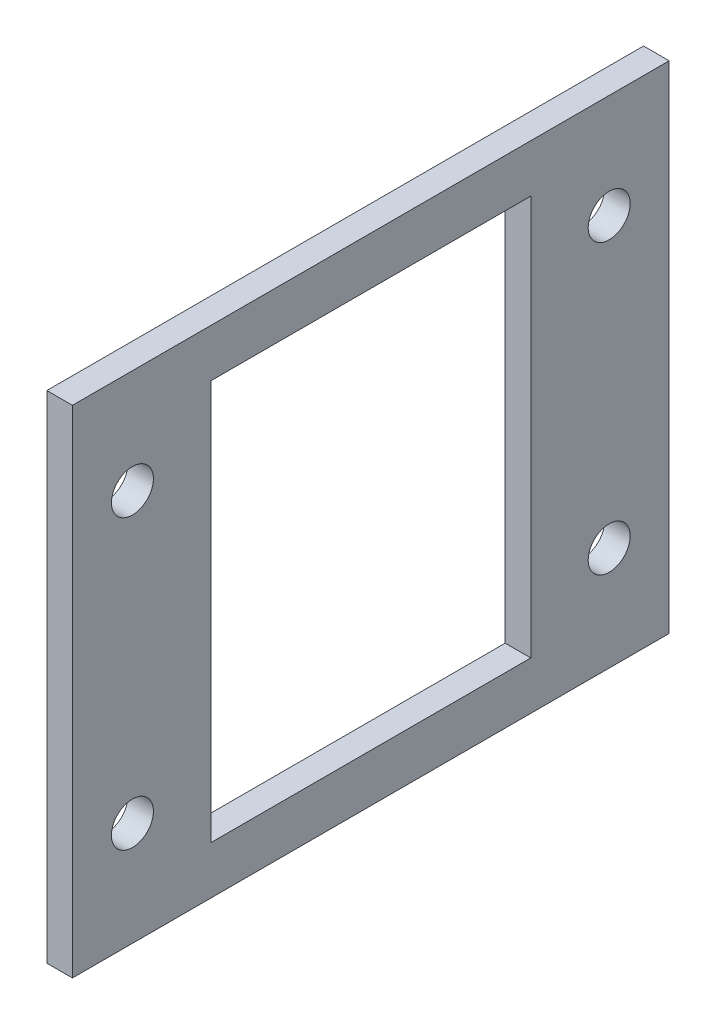
ISO-10303-21;
HEADER;
FILE_DESCRIPTION(('STEP AP214'),'2;1');
FILE_NAME('part.step','',(''),(''),'','','');
FILE_SCHEMA(('AUTOMOTIVE_DESIGN { 1 0 10303 214 1 1 1 1 }'));
ENDSEC;
DATA;
#1=APPLICATION_CONTEXT('core data for automotive mechanical design processes');
#2=APPLICATION_PROTOCOL_DEFINITION('international standard','automotive_design',2000,#1);
#3=PRODUCT_CONTEXT('',#1,'mechanical');
#4=PRODUCT('Part','Part','',(#3));
#5=PRODUCT_RELATED_PRODUCT_CATEGORY('part','',(#4));
#6=PRODUCT_DEFINITION_FORMATION('','',#4);
#7=PRODUCT_DEFINITION_CONTEXT('part definition',#1,'design');
#8=PRODUCT_DEFINITION('design','',#6,#7);
#9=PRODUCT_DEFINITION_SHAPE('','',#8);
#10=(LENGTH_UNIT() NAMED_UNIT(*) SI_UNIT(.MILLI.,.METRE.));
#11=(NAMED_UNIT(*) PLANE_ANGLE_UNIT() SI_UNIT($,.RADIAN.));
#12=(NAMED_UNIT(*) SI_UNIT($,.STERADIAN.) SOLID_ANGLE_UNIT());
#13=UNCERTAINTY_MEASURE_WITH_UNIT(LENGTH_MEASURE(1.E-05),#10,'distance_accuracy_value','');
#14=(GEOMETRIC_REPRESENTATION_CONTEXT(3) GLOBAL_UNCERTAINTY_ASSIGNED_CONTEXT((#13)) GLOBAL_UNIT_ASSIGNED_CONTEXT((#10,
#11,#12)) REPRESENTATION_CONTEXT('',''));
#15=CARTESIAN_POINT('',(0.,0.,0.));
#16=DIRECTION('',(0.,0.,1.));
#17=DIRECTION('',(1.,0.,0.));
#18=AXIS2_PLACEMENT_3D('',#15,#16,#17);
#19=CARTESIAN_POINT('',(3.2,0.,0.));
#20=DIRECTION('',(0.,0.,-1.));
#21=DIRECTION('',(-1.,0.,0.));
#22=AXIS2_PLACEMENT_3D('',#19,#20,#21);
#23=PLANE('',#22);
#24=DIRECTION('',(0.,-1.,0.));
#25=VECTOR('',#24,1.);
#26=CARTESIAN_POINT('',(0.,0.,0.));
#27=LINE('',#26,#25);
#28=CARTESIAN_POINT('',(0.,62.,0.));
#29=VERTEX_POINT('',#28);
#30=CARTESIAN_POINT('',(0.,0.,0.));
#31=VERTEX_POINT('',#30);
#32=EDGE_CURVE('E103',#29,#31,#27,.T.);
#33=ORIENTED_EDGE('',*,*,#32,.T.);
#34=DIRECTION('',(-1.,0.,0.));
#35=VECTOR('',#34,1.);
#36=CARTESIAN_POINT('',(3.2,0.,0.));
#37=LINE('',#36,#35);
#38=CARTESIAN_POINT('',(3.2,0.,0.));
#39=VERTEX_POINT('',#38);
#40=EDGE_CURVE('E11',#39,#31,#37,.T.);
#41=ORIENTED_EDGE('',*,*,#40,.F.);
#42=DIRECTION('',(0.,-1.,0.));
#43=VECTOR('',#42,1.);
#44=CARTESIAN_POINT('',(3.2,0.,0.));
#45=LINE('',#44,#43);
#46=CARTESIAN_POINT('',(3.2,62.,0.));
#47=VERTEX_POINT('',#46);
#48=EDGE_CURVE('E132',#47,#39,#45,.T.);
#49=ORIENTED_EDGE('',*,*,#48,.F.);
#50=DIRECTION('',(-1.,0.,0.));
#51=VECTOR('',#50,1.);
#52=CARTESIAN_POINT('',(3.2,62.,0.));
#53=LINE('',#52,#51);
#54=EDGE_CURVE('E142',#47,#29,#53,.T.);
#55=ORIENTED_EDGE('',*,*,#54,.T.);
#56=EDGE_LOOP('',(#33,#41,#49,#55));
#57=FACE_BOUND('',#56,.T.);
#58=ADVANCED_FACE('F33',(#57),#23,.F.);
#59=CARTESIAN_POINT('',(3.2,0.,0.));
#60=DIRECTION('',(0.,1.,0.));
#61=DIRECTION('',(0.,0.,1.));
#62=AXIS2_PLACEMENT_3D('',#59,#60,#61);
#63=PLANE('',#62);
#64=DIRECTION('',(0.,0.,-1.));
#65=VECTOR('',#64,1.);
#66=CARTESIAN_POINT('',(0.,0.,0.));
#67=LINE('',#66,#65);
#68=CARTESIAN_POINT('',(0.,0.,-74.6));
#69=VERTEX_POINT('',#68);
#70=EDGE_CURVE('E145',#31,#69,#67,.T.);
#71=ORIENTED_EDGE('',*,*,#70,.T.);
#72=DIRECTION('',(-1.,0.,0.));
#73=VECTOR('',#72,1.);
#74=CARTESIAN_POINT('',(3.2,0.,-74.6));
#75=LINE('',#74,#73);
#76=CARTESIAN_POINT('',(3.2,0.,-74.6));
#77=VERTEX_POINT('',#76);
#78=EDGE_CURVE('E40',#77,#69,#75,.T.);
#79=ORIENTED_EDGE('',*,*,#78,.F.);
#80=DIRECTION('',(0.,0.,-1.));
#81=VECTOR('',#80,1.);
#82=CARTESIAN_POINT('',(3.2,0.,0.));
#83=LINE('',#82,#81);
#84=EDGE_CURVE('E135',#39,#77,#83,.T.);
#85=ORIENTED_EDGE('',*,*,#84,.F.);
#86=ORIENTED_EDGE('',*,*,#40,.T.);
#87=EDGE_LOOP('',(#71,#79,#85,#86));
#88=FACE_BOUND('',#87,.T.);
#89=ADVANCED_FACE('F173',(#88),#63,.F.);
#90=CARTESIAN_POINT('',(3.2,0.,-74.6));
#91=DIRECTION('',(0.,0.,1.));
#92=DIRECTION('',(1.,0.,0.));
#93=AXIS2_PLACEMENT_3D('',#90,#91,#92);
#94=PLANE('',#93);
#95=DIRECTION('',(0.,1.,0.));
#96=VECTOR('',#95,1.);
#97=CARTESIAN_POINT('',(0.,0.,-74.6));
#98=LINE('',#97,#96);
#99=CARTESIAN_POINT('',(0.,62.,-74.6));
#100=VERTEX_POINT('',#99);
#101=EDGE_CURVE('E147',#69,#100,#98,.T.);
#102=ORIENTED_EDGE('',*,*,#101,.T.);
#103=DIRECTION('',(-1.,0.,0.));
#104=VECTOR('',#103,1.);
#105=CARTESIAN_POINT('',(3.2,62.,-74.6));
#106=LINE('',#105,#104);
#107=CARTESIAN_POINT('',(3.2,62.,-74.6));
#108=VERTEX_POINT('',#107);
#109=EDGE_CURVE('E152',#108,#100,#106,.T.);
#110=ORIENTED_EDGE('',*,*,#109,.F.);
#111=DIRECTION('',(0.,1.,0.));
#112=VECTOR('',#111,1.);
#113=CARTESIAN_POINT('',(3.2,0.,-74.6));
#114=LINE('',#113,#112);
#115=EDGE_CURVE('E138',#77,#108,#114,.T.);
#116=ORIENTED_EDGE('',*,*,#115,.F.);
#117=ORIENTED_EDGE('',*,*,#78,.T.);
#118=EDGE_LOOP('',(#102,#110,#116,#117));
#119=FACE_BOUND('',#118,.T.);
#120=ADVANCED_FACE('F159',(#119),#94,.F.);
#121=CARTESIAN_POINT('',(3.2,62.,0.));
#122=DIRECTION('',(0.,-1.,0.));
#123=DIRECTION('',(0.,0.,-1.));
#124=AXIS2_PLACEMENT_3D('',#121,#122,#123);
#125=PLANE('',#124);
#126=DIRECTION('',(0.,0.,1.));
#127=VECTOR('',#126,1.);
#128=CARTESIAN_POINT('',(0.,62.,0.));
#129=LINE('',#128,#127);
#130=EDGE_CURVE('E136',#100,#29,#129,.T.);
#131=ORIENTED_EDGE('',*,*,#130,.T.);
#132=ORIENTED_EDGE('',*,*,#54,.F.);
#133=DIRECTION('',(0.,0.,1.));
#134=VECTOR('',#133,1.);
#135=CARTESIAN_POINT('',(3.2,62.,0.));
#136=LINE('',#135,#134);
#137=EDGE_CURVE('E140',#108,#47,#136,.T.);
#138=ORIENTED_EDGE('',*,*,#137,.F.);
#139=ORIENTED_EDGE('',*,*,#109,.T.);
#140=EDGE_LOOP('',(#131,#132,#138,#139));
#141=FACE_BOUND('',#140,.T.);
#142=ADVANCED_FACE('F166',(#141),#125,.F.);
#143=CARTESIAN_POINT('',(3.2,0.,0.));
#144=DIRECTION('',(-1.,0.,0.));
#145=DIRECTION('',(0.,0.,1.));
#146=AXIS2_PLACEMENT_3D('',#143,#144,#145);
#147=PLANE('',#146);
#148=CARTESIAN_POINT('',(3.2,13.,-7.49999999999997));
#149=DIRECTION('',(-1.,0.,0.));
#150=DIRECTION('',(0.,0.,1.));
#151=AXIS2_PLACEMENT_3D('',#148,#149,#150);
#152=CIRCLE('',#151,2.62500000000008);
#153=CARTESIAN_POINT('',(3.2,13.,-4.87499999999988));
#154=VERTEX_POINT('',#153);
#155=EDGE_CURVE('E224',#154,#154,#152,.F.);
#156=ORIENTED_EDGE('',*,*,#155,.F.);
#157=EDGE_LOOP('',(#156));
#158=FACE_BOUND('',#157,.T.);
#159=CARTESIAN_POINT('',(3.2,49.0000000000004,-7.5));
#160=DIRECTION('',(-1.,0.,0.));
#161=DIRECTION('',(0.,0.,1.));
#162=AXIS2_PLACEMENT_3D('',#159,#160,#161);
#163=CIRCLE('',#162,2.625);
#164=CARTESIAN_POINT('',(3.2,49.0000000000004,-4.875));
#165=VERTEX_POINT('',#164);
#166=EDGE_CURVE('E228',#165,#165,#163,.F.);
#167=ORIENTED_EDGE('',*,*,#166,.F.);
#168=EDGE_LOOP('',(#167));
#169=FACE_BOUND('',#168,.T.);
#170=CARTESIAN_POINT('',(3.2,49.0000000000002,-67.0999999999998));
#171=DIRECTION('',(-1.,0.,0.));
#172=DIRECTION('',(0.,0.,1.));
#173=AXIS2_PLACEMENT_3D('',#170,#171,#172);
#174=CIRCLE('',#173,2.62499999999999);
#175=CARTESIAN_POINT('',(3.2,49.0000000000002,-64.4749999999998));
#176=VERTEX_POINT('',#175);
#177=EDGE_CURVE('E237',#176,#176,#174,.F.);
#178=ORIENTED_EDGE('',*,*,#177,.F.);
#179=EDGE_LOOP('',(#178));
#180=FACE_BOUND('',#179,.T.);
#181=CARTESIAN_POINT('',(3.2,13.0000000000003,-67.0999999999998));
#182=DIRECTION('',(-1.,0.,0.));
#183=DIRECTION('',(0.,0.,1.));
#184=AXIS2_PLACEMENT_3D('',#181,#182,#183);
#185=CIRCLE('',#184,2.625);
#186=CARTESIAN_POINT('',(3.2,13.0000000000003,-64.4749999999998));
#187=VERTEX_POINT('',#186);
#188=EDGE_CURVE('E243',#187,#187,#185,.F.);
#189=ORIENTED_EDGE('',*,*,#188,.F.);
#190=EDGE_LOOP('',(#189));
#191=FACE_BOUND('',#190,.T.);
#192=DIRECTION('',(0.,0.,-1.));
#193=VECTOR('',#192,1.);
#194=CARTESIAN_POINT('',(3.2,6.00000000000001,-17.3));
#195=LINE('',#194,#193);
#196=CARTESIAN_POINT('',(3.2,6.00000000000001,-17.3));
#197=VERTEX_POINT('',#196);
#198=CARTESIAN_POINT('',(3.2,6.00000000000001,-57.3));
#199=VERTEX_POINT('',#198);
#200=EDGE_CURVE('E116',#197,#199,#195,.T.);
#201=ORIENTED_EDGE('',*,*,#200,.F.);
#202=DIRECTION('',(0.,-1.,0.));
#203=VECTOR('',#202,1.);
#204=CARTESIAN_POINT('',(3.2,6.00000000000001,-17.3));
#205=LINE('',#204,#203);
#206=CARTESIAN_POINT('',(3.2,56.,-17.3));
#207=VERTEX_POINT('',#206);
#208=EDGE_CURVE('E47',#207,#197,#205,.T.);
#209=ORIENTED_EDGE('',*,*,#208,.F.);
#210=DIRECTION('',(0.,0.,1.));
#211=VECTOR('',#210,1.);
#212=CARTESIAN_POINT('',(3.2,56.,-17.3));
#213=LINE('',#212,#211);
#214=CARTESIAN_POINT('',(3.2,56.,-57.3));
#215=VERTEX_POINT('',#214);
#216=EDGE_CURVE('E109',#215,#207,#213,.T.);
#217=ORIENTED_EDGE('',*,*,#216,.F.);
#218=DIRECTION('',(0.,1.,0.));
#219=VECTOR('',#218,1.);
#220=CARTESIAN_POINT('',(3.2,6.00000000000001,-57.3));
#221=LINE('',#220,#219);
#222=EDGE_CURVE('E123',#199,#215,#221,.T.);
#223=ORIENTED_EDGE('',*,*,#222,.F.);
#224=EDGE_LOOP('',(#201,#209,#217,#223));
#225=FACE_BOUND('',#224,.T.);
#226=ORIENTED_EDGE('',*,*,#48,.T.);
#227=ORIENTED_EDGE('',*,*,#84,.T.);
#228=ORIENTED_EDGE('',*,*,#115,.T.);
#229=ORIENTED_EDGE('',*,*,#137,.T.);
#230=EDGE_LOOP('',(#226,#227,#228,#229));
#231=FACE_BOUND('',#230,.T.);
#232=ADVANCED_FACE('F172',(#158,#169,#180,#191,#225,#231),#147,.F.);
#233=CARTESIAN_POINT('',(0.,0.,0.));
#234=DIRECTION('',(-1.,0.,0.));
#235=DIRECTION('',(0.,0.,1.));
#236=AXIS2_PLACEMENT_3D('',#233,#234,#235);
#237=PLANE('',#236);
#238=CARTESIAN_POINT('',(0.,13.,-7.49999999999997));
#239=DIRECTION('',(-1.,0.,0.));
#240=DIRECTION('',(0.,0.,1.));
#241=AXIS2_PLACEMENT_3D('',#238,#239,#240);
#242=CIRCLE('',#241,2.62500000000008);
#243=CARTESIAN_POINT('',(0.,13.,-4.87499999999988));
#244=VERTEX_POINT('',#243);
#245=EDGE_CURVE('E221',#244,#244,#242,.T.);
#246=ORIENTED_EDGE('',*,*,#245,.F.);
#247=EDGE_LOOP('',(#246));
#248=FACE_BOUND('',#247,.T.);
#249=CARTESIAN_POINT('',(0.,49.0000000000004,-7.5));
#250=DIRECTION('',(-1.,0.,0.));
#251=DIRECTION('',(0.,0.,1.));
#252=AXIS2_PLACEMENT_3D('',#249,#250,#251);
#253=CIRCLE('',#252,2.625);
#254=CARTESIAN_POINT('',(0.,49.0000000000004,-4.875));
#255=VERTEX_POINT('',#254);
#256=EDGE_CURVE('E225',#255,#255,#253,.T.);
#257=ORIENTED_EDGE('',*,*,#256,.F.);
#258=EDGE_LOOP('',(#257));
#259=FACE_BOUND('',#258,.T.);
#260=CARTESIAN_POINT('',(0.,49.0000000000002,-67.0999999999998));
#261=DIRECTION('',(-1.,0.,0.));
#262=DIRECTION('',(0.,0.,1.));
#263=AXIS2_PLACEMENT_3D('',#260,#261,#262);
#264=CIRCLE('',#263,2.62499999999999);
#265=CARTESIAN_POINT('',(0.,49.0000000000002,-64.4749999999998));
#266=VERTEX_POINT('',#265);
#267=EDGE_CURVE('E234',#266,#266,#264,.T.);
#268=ORIENTED_EDGE('',*,*,#267,.F.);
#269=EDGE_LOOP('',(#268));
#270=FACE_BOUND('',#269,.T.);
#271=CARTESIAN_POINT('',(0.,13.0000000000003,-67.0999999999998));
#272=DIRECTION('',(-1.,0.,0.));
#273=DIRECTION('',(0.,0.,1.));
#274=AXIS2_PLACEMENT_3D('',#271,#272,#273);
#275=CIRCLE('',#274,2.625);
#276=CARTESIAN_POINT('',(0.,13.0000000000003,-64.4749999999998));
#277=VERTEX_POINT('',#276);
#278=EDGE_CURVE('E240',#277,#277,#275,.T.);
#279=ORIENTED_EDGE('',*,*,#278,.F.);
#280=EDGE_LOOP('',(#279));
#281=FACE_BOUND('',#280,.T.);
#282=DIRECTION('',(0.,-1.,0.));
#283=VECTOR('',#282,1.);
#284=CARTESIAN_POINT('',(0.,6.00000000000001,-17.3));
#285=LINE('',#284,#283);
#286=CARTESIAN_POINT('',(0.,56.,-17.3));
#287=VERTEX_POINT('',#286);
#288=CARTESIAN_POINT('',(0.,6.00000000000001,-17.3));
#289=VERTEX_POINT('',#288);
#290=EDGE_CURVE('E107',#287,#289,#285,.T.);
#291=ORIENTED_EDGE('',*,*,#290,.T.);
#292=DIRECTION('',(0.,0.,-1.));
#293=VECTOR('',#292,1.);
#294=CARTESIAN_POINT('',(0.,6.00000000000001,-17.3));
#295=LINE('',#294,#293);
#296=CARTESIAN_POINT('',(0.,6.00000000000001,-57.3));
#297=VERTEX_POINT('',#296);
#298=EDGE_CURVE('E96',#289,#297,#295,.T.);
#299=ORIENTED_EDGE('',*,*,#298,.T.);
#300=DIRECTION('',(0.,1.,0.));
#301=VECTOR('',#300,1.);
#302=CARTESIAN_POINT('',(0.,6.00000000000001,-57.3));
#303=LINE('',#302,#301);
#304=CARTESIAN_POINT('',(0.,56.,-57.3));
#305=VERTEX_POINT('',#304);
#306=EDGE_CURVE('E118',#297,#305,#303,.T.);
#307=ORIENTED_EDGE('',*,*,#306,.T.);
#308=DIRECTION('',(0.,0.,1.));
#309=VECTOR('',#308,1.);
#310=CARTESIAN_POINT('',(0.,56.,-17.3));
#311=LINE('',#310,#309);
#312=EDGE_CURVE('E114',#305,#287,#311,.T.);
#313=ORIENTED_EDGE('',*,*,#312,.T.);
#314=EDGE_LOOP('',(#291,#299,#307,#313));
#315=FACE_BOUND('',#314,.T.);
#316=ORIENTED_EDGE('',*,*,#32,.F.);
#317=ORIENTED_EDGE('',*,*,#130,.F.);
#318=ORIENTED_EDGE('',*,*,#101,.F.);
#319=ORIENTED_EDGE('',*,*,#70,.F.);
#320=EDGE_LOOP('',(#316,#317,#318,#319));
#321=FACE_BOUND('',#320,.T.);
#322=ADVANCED_FACE('F112',(#248,#259,#270,#281,#315,#321),#237,.T.);
#323=CARTESIAN_POINT('',(-0.00100000000000013,6.00000000000001,-17.3));
#324=DIRECTION('',(0.,0.,1.));
#325=DIRECTION('',(1.,0.,0.));
#326=AXIS2_PLACEMENT_3D('',#323,#324,#325);
#327=PLANE('',#326);
#328=DIRECTION('',(1.,0.,0.));
#329=VECTOR('',#328,1.);
#330=CARTESIAN_POINT('',(-0.00100000000000013,56.,-17.3));
#331=LINE('',#330,#329);
#332=EDGE_CURVE('E104',#287,#207,#331,.T.);
#333=ORIENTED_EDGE('',*,*,#332,.T.);
#334=ORIENTED_EDGE('',*,*,#208,.T.);
#335=DIRECTION('',(1.,0.,0.));
#336=VECTOR('',#335,1.);
#337=CARTESIAN_POINT('',(-0.00100000000000013,6.00000000000001,-17.3));
#338=LINE('',#337,#336);
#339=EDGE_CURVE('E98',#289,#197,#338,.T.);
#340=ORIENTED_EDGE('',*,*,#339,.F.);
#341=ORIENTED_EDGE('',*,*,#290,.F.);
#342=EDGE_LOOP('',(#333,#334,#340,#341));
#343=FACE_BOUND('',#342,.T.);
#344=ADVANCED_FACE('F106',(#343),#327,.F.);
#345=CARTESIAN_POINT('',(-0.00100000000000013,56.,-17.3));
#346=DIRECTION('',(0.,1.,0.));
#347=DIRECTION('',(0.,0.,1.));
#348=AXIS2_PLACEMENT_3D('',#345,#346,#347);
#349=PLANE('',#348);
#350=DIRECTION('',(1.,0.,0.));
#351=VECTOR('',#350,1.);
#352=CARTESIAN_POINT('',(-0.00100000000000013,56.,-57.3));
#353=LINE('',#352,#351);
#354=EDGE_CURVE('E129',#305,#215,#353,.T.);
#355=ORIENTED_EDGE('',*,*,#354,.T.);
#356=ORIENTED_EDGE('',*,*,#216,.T.);
#357=ORIENTED_EDGE('',*,*,#332,.F.);
#358=ORIENTED_EDGE('',*,*,#312,.F.);
#359=EDGE_LOOP('',(#355,#356,#357,#358));
#360=FACE_BOUND('',#359,.T.);
#361=ADVANCED_FACE('F191',(#360),#349,.F.);
#362=CARTESIAN_POINT('',(-0.00100000000000013,6.00000000000001,-57.3));
#363=DIRECTION('',(0.,0.,-1.));
#364=DIRECTION('',(-1.,0.,0.));
#365=AXIS2_PLACEMENT_3D('',#362,#363,#364);
#366=PLANE('',#365);
#367=DIRECTION('',(1.,0.,0.));
#368=VECTOR('',#367,1.);
#369=CARTESIAN_POINT('',(-0.00100000000000013,6.00000000000001,-57.3));
#370=LINE('',#369,#368);
#371=EDGE_CURVE('E55',#297,#199,#370,.T.);
#372=ORIENTED_EDGE('',*,*,#371,.T.);
#373=ORIENTED_EDGE('',*,*,#222,.T.);
#374=ORIENTED_EDGE('',*,*,#354,.F.);
#375=ORIENTED_EDGE('',*,*,#306,.F.);
#376=EDGE_LOOP('',(#372,#373,#374,#375));
#377=FACE_BOUND('',#376,.T.);
#378=ADVANCED_FACE('F195',(#377),#366,.F.);
#379=CARTESIAN_POINT('',(-0.00100000000000013,6.00000000000001,-17.3));
#380=DIRECTION('',(0.,-1.,0.));
#381=DIRECTION('',(0.,0.,-1.));
#382=AXIS2_PLACEMENT_3D('',#379,#380,#381);
#383=PLANE('',#382);
#384=ORIENTED_EDGE('',*,*,#339,.T.);
#385=ORIENTED_EDGE('',*,*,#200,.T.);
#386=ORIENTED_EDGE('',*,*,#371,.F.);
#387=ORIENTED_EDGE('',*,*,#298,.F.);
#388=EDGE_LOOP('',(#384,#385,#386,#387));
#389=FACE_BOUND('',#388,.T.);
#390=ADVANCED_FACE('F97',(#389),#383,.F.);
#391=CARTESIAN_POINT('',(3.201,13.0000000000003,-67.0999999999998));
#392=DIRECTION('',(-1.,0.,0.));
#393=DIRECTION('',(0.,0.,1.));
#394=AXIS2_PLACEMENT_3D('',#391,#392,#393);
#395=CYLINDRICAL_SURFACE('',#394,2.625);
#396=ORIENTED_EDGE('',*,*,#278,.T.);
#397=EDGE_LOOP('',(#396));
#398=FACE_BOUND('',#397,.T.);
#399=ORIENTED_EDGE('',*,*,#188,.T.);
#400=EDGE_LOOP('',(#399));
#401=FACE_BOUND('',#400,.T.);
#402=ADVANCED_FACE('F194',(#398,#401),#395,.F.);
#403=CARTESIAN_POINT('',(3.201,49.0000000000002,-67.0999999999998));
#404=DIRECTION('',(-1.,0.,0.));
#405=DIRECTION('',(0.,0.,1.));
#406=AXIS2_PLACEMENT_3D('',#403,#404,#405);
#407=CYLINDRICAL_SURFACE('',#406,2.62499999999999);
#408=ORIENTED_EDGE('',*,*,#267,.T.);
#409=EDGE_LOOP('',(#408));
#410=FACE_BOUND('',#409,.T.);
#411=ORIENTED_EDGE('',*,*,#177,.T.);
#412=EDGE_LOOP('',(#411));
#413=FACE_BOUND('',#412,.T.);
#414=ADVANCED_FACE('F204',(#410,#413),#407,.F.);
#415=CARTESIAN_POINT('',(3.201,49.0000000000004,-7.5));
#416=DIRECTION('',(-1.,0.,0.));
#417=DIRECTION('',(0.,0.,1.));
#418=AXIS2_PLACEMENT_3D('',#415,#416,#417);
#419=CYLINDRICAL_SURFACE('',#418,2.625);
#420=ORIENTED_EDGE('',*,*,#256,.T.);
#421=EDGE_LOOP('',(#420));
#422=FACE_BOUND('',#421,.T.);
#423=ORIENTED_EDGE('',*,*,#166,.T.);
#424=EDGE_LOOP('',(#423));
#425=FACE_BOUND('',#424,.T.);
#426=ADVANCED_FACE('F208',(#422,#425),#419,.F.);
#427=CARTESIAN_POINT('',(3.201,13.,-7.49999999999997));
#428=DIRECTION('',(-1.,0.,0.));
#429=DIRECTION('',(0.,0.,1.));
#430=AXIS2_PLACEMENT_3D('',#427,#428,#429);
#431=CYLINDRICAL_SURFACE('',#430,2.62500000000008);
#432=ORIENTED_EDGE('',*,*,#245,.T.);
#433=EDGE_LOOP('',(#432));
#434=FACE_BOUND('',#433,.T.);
#435=ORIENTED_EDGE('',*,*,#155,.T.);
#436=EDGE_LOOP('',(#435));
#437=FACE_BOUND('',#436,.T.);
#438=ADVANCED_FACE('F212',(#434,#437),#431,.F.);
#439=CLOSED_SHELL('',(#58,#89,#120,#142,#232,#322,#344,#361,#378,#390,#402,#414,#426,#438));
#440=MANIFOLD_SOLID_BREP('B2',#439);
#441=ADVANCED_BREP_SHAPE_REPRESENTATION('',(#18,#440),#14);
#442=SHAPE_DEFINITION_REPRESENTATION(#9,#441);
ENDSEC;
END-ISO-10303-21;
